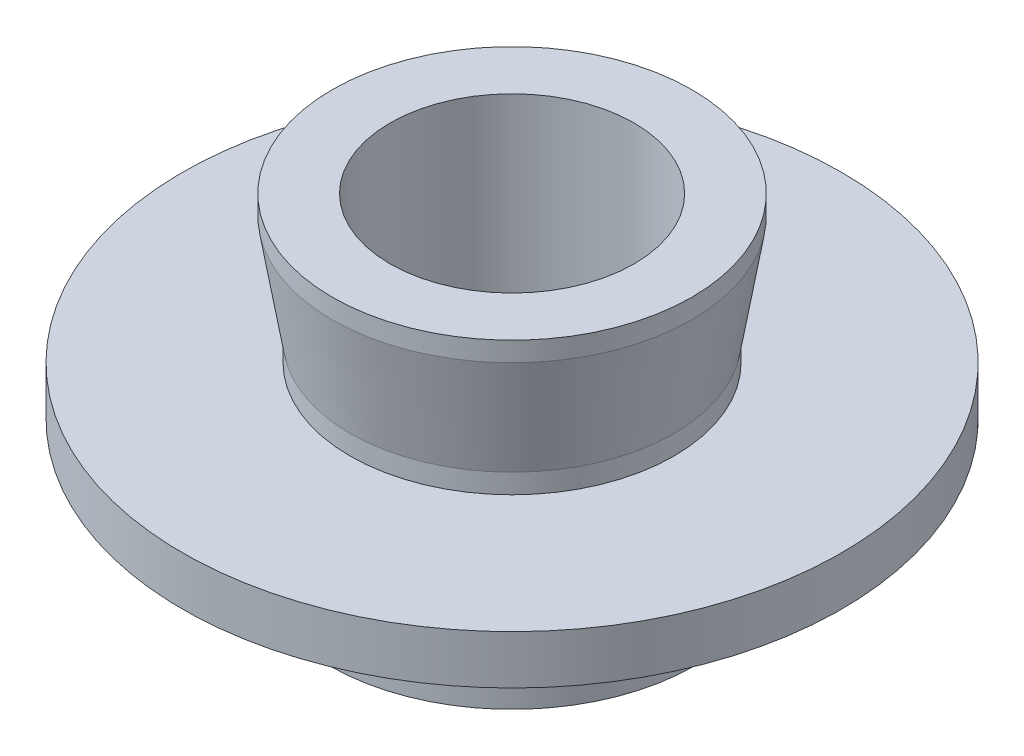
ISO-10303-21;
HEADER;
FILE_DESCRIPTION(('STEP AP214'),'2;1');
FILE_NAME('part.step','',(''),(''),'','','');
FILE_SCHEMA(('AUTOMOTIVE_DESIGN { 1 0 10303 214 1 1 1 1 }'));
ENDSEC;
DATA;
#1=APPLICATION_CONTEXT('core data for automotive mechanical design processes');
#2=APPLICATION_PROTOCOL_DEFINITION('international standard','automotive_design',2000,#1);
#3=PRODUCT_CONTEXT('',#1,'mechanical');
#4=PRODUCT('Part','Part','',(#3));
#5=PRODUCT_RELATED_PRODUCT_CATEGORY('part','',(#4));
#6=PRODUCT_DEFINITION_FORMATION('','',#4);
#7=PRODUCT_DEFINITION_CONTEXT('part definition',#1,'design');
#8=PRODUCT_DEFINITION('design','',#6,#7);
#9=PRODUCT_DEFINITION_SHAPE('','',#8);
#10=(LENGTH_UNIT() NAMED_UNIT(*) SI_UNIT(.MILLI.,.METRE.));
#11=(NAMED_UNIT(*) PLANE_ANGLE_UNIT() SI_UNIT($,.RADIAN.));
#12=(NAMED_UNIT(*) SI_UNIT($,.STERADIAN.) SOLID_ANGLE_UNIT());
#13=UNCERTAINTY_MEASURE_WITH_UNIT(LENGTH_MEASURE(1.E-05),#10,'distance_accuracy_value','');
#14=(GEOMETRIC_REPRESENTATION_CONTEXT(3) GLOBAL_UNCERTAINTY_ASSIGNED_CONTEXT((#13)) GLOBAL_UNIT_ASSIGNED_CONTEXT((#10,
#11,#12)) REPRESENTATION_CONTEXT('',''));
#15=CARTESIAN_POINT('',(0.,0.,0.));
#16=DIRECTION('',(0.,0.,1.));
#17=DIRECTION('',(1.,0.,0.));
#18=AXIS2_PLACEMENT_3D('',#15,#16,#17);
#19=CARTESIAN_POINT('',(-7.5,0.,0.));
#20=DIRECTION('',(0.,1.,0.));
#21=DIRECTION('',(0.,0.,1.));
#22=AXIS2_PLACEMENT_3D('',#19,#20,#21);
#23=PLANE('',#22);
#24=CARTESIAN_POINT('',(0.,0.,0.));
#25=DIRECTION('',(0.,-1.,0.));
#26=DIRECTION('',(0.,0.,-1.));
#27=AXIS2_PLACEMENT_3D('',#24,#25,#26);
#28=CIRCLE('',#27,5.);
#29=CARTESIAN_POINT('',(0.,0.,-5.));
#30=VERTEX_POINT('',#29);
#31=EDGE_CURVE('E10',#30,#30,#28,.T.);
#32=ORIENTED_EDGE('',*,*,#31,.F.);
#33=EDGE_LOOP('',(#32));
#34=FACE_BOUND('',#33,.T.);
#35=CARTESIAN_POINT('',(0.,0.,0.));
#36=DIRECTION('',(0.,-1.,0.));
#37=DIRECTION('',(0.,0.,-1.));
#38=AXIS2_PLACEMENT_3D('',#35,#36,#37);
#39=CIRCLE('',#38,7.5);
#40=CARTESIAN_POINT('',(0.,0.,-7.5));
#41=VERTEX_POINT('',#40);
#42=EDGE_CURVE('E77',#41,#41,#39,.T.);
#43=ORIENTED_EDGE('',*,*,#42,.T.);
#44=EDGE_LOOP('',(#43));
#45=FACE_BOUND('',#44,.T.);
#46=ADVANCED_FACE('F37',(#34,#45),#23,.F.);
#47=CARTESIAN_POINT('',(0.,0.,0.));
#48=DIRECTION('',(0.,-1.,0.));
#49=DIRECTION('',(0.,0.,-1.));
#50=AXIS2_PLACEMENT_3D('',#47,#48,#49);
#51=CYLINDRICAL_SURFACE('',#50,5.);
#52=CARTESIAN_POINT('',(0.,13.,0.));
#53=DIRECTION('',(0.,-1.,0.));
#54=DIRECTION('',(0.,0.,-1.));
#55=AXIS2_PLACEMENT_3D('',#52,#53,#54);
#56=CIRCLE('',#55,5.);
#57=CARTESIAN_POINT('',(0.,13.,-5.));
#58=VERTEX_POINT('',#57);
#59=EDGE_CURVE('E43',#58,#58,#56,.T.);
#60=ORIENTED_EDGE('',*,*,#59,.F.);
#61=EDGE_LOOP('',(#60));
#62=FACE_BOUND('',#61,.T.);
#63=ORIENTED_EDGE('',*,*,#31,.T.);
#64=EDGE_LOOP('',(#63));
#65=FACE_BOUND('',#64,.T.);
#66=ADVANCED_FACE('F138',(#62,#65),#51,.F.);
#67=CARTESIAN_POINT('',(-5.,13.,0.));
#68=DIRECTION('',(0.,-1.,0.));
#69=DIRECTION('',(0.,0.,-1.));
#70=AXIS2_PLACEMENT_3D('',#67,#68,#69);
#71=PLANE('',#70);
#72=CARTESIAN_POINT('',(0.,13.,0.));
#73=DIRECTION('',(0.,-1.,0.));
#74=DIRECTION('',(0.,0.,-1.));
#75=AXIS2_PLACEMENT_3D('',#72,#73,#74);
#76=CIRCLE('',#75,7.365);
#77=CARTESIAN_POINT('',(0.,13.,-7.365));
#78=VERTEX_POINT('',#77);
#79=EDGE_CURVE('E47',#78,#78,#76,.T.);
#80=ORIENTED_EDGE('',*,*,#79,.F.);
#81=EDGE_LOOP('',(#80));
#82=FACE_BOUND('',#81,.T.);
#83=ORIENTED_EDGE('',*,*,#59,.T.);
#84=EDGE_LOOP('',(#83));
#85=FACE_BOUND('',#84,.T.);
#86=ADVANCED_FACE('F133',(#82,#85),#71,.F.);
#87=CARTESIAN_POINT('',(0.,0.,0.));
#88=DIRECTION('',(0.,-1.,0.));
#89=DIRECTION('',(0.,0.,-1.));
#90=AXIS2_PLACEMENT_3D('',#87,#88,#89);
#91=CYLINDRICAL_SURFACE('',#90,7.365);
#92=CARTESIAN_POINT('',(0.,12.2,0.));
#93=DIRECTION('',(0.,-1.,0.));
#94=DIRECTION('',(0.,0.,-1.));
#95=AXIS2_PLACEMENT_3D('',#92,#93,#94);
#96=CIRCLE('',#95,7.365);
#97=CARTESIAN_POINT('',(0.,12.2,-7.365));
#98=VERTEX_POINT('',#97);
#99=EDGE_CURVE('E51',#98,#98,#96,.T.);
#100=ORIENTED_EDGE('',*,*,#99,.F.);
#101=EDGE_LOOP('',(#100));
#102=FACE_BOUND('',#101,.T.);
#103=ORIENTED_EDGE('',*,*,#79,.T.);
#104=EDGE_LOOP('',(#103));
#105=FACE_BOUND('',#104,.T.);
#106=ADVANCED_FACE('F127',(#102,#105),#91,.T.);
#107=CARTESIAN_POINT('',(0.,12.2,0.));
#108=DIRECTION('',(0.,1.,0.));
#109=DIRECTION('',(0.,0.,1.));
#110=AXIS2_PLACEMENT_3D('',#107,#108,#109);
#111=CONICAL_SURFACE('',#110,7.365,0.164411486247027);
#112=CARTESIAN_POINT('',(0.,7.8,0.));
#113=DIRECTION('',(0.,-1.,0.));
#114=DIRECTION('',(0.,0.,-1.));
#115=AXIS2_PLACEMENT_3D('',#112,#113,#114);
#116=CIRCLE('',#115,6.635);
#117=CARTESIAN_POINT('',(0.,7.8,-6.635));
#118=VERTEX_POINT('',#117);
#119=EDGE_CURVE('E56',#118,#118,#116,.T.);
#120=ORIENTED_EDGE('',*,*,#119,.F.);
#121=EDGE_LOOP('',(#120));
#122=FACE_BOUND('',#121,.T.);
#123=ORIENTED_EDGE('',*,*,#99,.T.);
#124=EDGE_LOOP('',(#123));
#125=FACE_BOUND('',#124,.T.);
#126=ADVANCED_FACE('F121',(#122,#125),#111,.T.);
#127=CARTESIAN_POINT('',(0.,0.,0.));
#128=DIRECTION('',(0.,-1.,0.));
#129=DIRECTION('',(0.,0.,-1.));
#130=AXIS2_PLACEMENT_3D('',#127,#128,#129);
#131=CYLINDRICAL_SURFACE('',#130,6.635);
#132=CARTESIAN_POINT('',(0.,7.,0.));
#133=DIRECTION('',(0.,-1.,0.));
#134=DIRECTION('',(0.,0.,-1.));
#135=AXIS2_PLACEMENT_3D('',#132,#133,#134);
#136=CIRCLE('',#135,6.635);
#137=CARTESIAN_POINT('',(0.,7.,-6.635));
#138=VERTEX_POINT('',#137);
#139=EDGE_CURVE('E59',#138,#138,#136,.T.);
#140=ORIENTED_EDGE('',*,*,#139,.F.);
#141=EDGE_LOOP('',(#140));
#142=FACE_BOUND('',#141,.T.);
#143=ORIENTED_EDGE('',*,*,#119,.T.);
#144=EDGE_LOOP('',(#143));
#145=FACE_BOUND('',#144,.T.);
#146=ADVANCED_FACE('F115',(#142,#145),#131,.T.);
#147=CARTESIAN_POINT('',(-6.635,7.,0.));
#148=DIRECTION('',(0.,-1.,0.));
#149=DIRECTION('',(0.,0.,-1.));
#150=AXIS2_PLACEMENT_3D('',#147,#148,#149);
#151=PLANE('',#150);
#152=CARTESIAN_POINT('',(0.,7.,0.));
#153=DIRECTION('',(0.,-1.,0.));
#154=DIRECTION('',(0.,0.,-1.));
#155=AXIS2_PLACEMENT_3D('',#152,#153,#154);
#156=CIRCLE('',#155,13.5);
#157=CARTESIAN_POINT('',(0.,7.,-13.5));
#158=VERTEX_POINT('',#157);
#159=EDGE_CURVE('E62',#158,#158,#156,.T.);
#160=ORIENTED_EDGE('',*,*,#159,.F.);
#161=EDGE_LOOP('',(#160));
#162=FACE_BOUND('',#161,.T.);
#163=ORIENTED_EDGE('',*,*,#139,.T.);
#164=EDGE_LOOP('',(#163));
#165=FACE_BOUND('',#164,.T.);
#166=ADVANCED_FACE('F109',(#162,#165),#151,.F.);
#167=CARTESIAN_POINT('',(0.,0.,0.));
#168=DIRECTION('',(0.,-1.,0.));
#169=DIRECTION('',(0.,0.,-1.));
#170=AXIS2_PLACEMENT_3D('',#167,#168,#169);
#171=CYLINDRICAL_SURFACE('',#170,13.5);
#172=CARTESIAN_POINT('',(0.,5.,0.));
#173=DIRECTION('',(0.,-1.,0.));
#174=DIRECTION('',(0.,0.,-1.));
#175=AXIS2_PLACEMENT_3D('',#172,#173,#174);
#176=CIRCLE('',#175,13.5);
#177=CARTESIAN_POINT('',(0.,5.,-13.5));
#178=VERTEX_POINT('',#177);
#179=EDGE_CURVE('E65',#178,#178,#176,.T.);
#180=ORIENTED_EDGE('',*,*,#179,.F.);
#181=EDGE_LOOP('',(#180));
#182=FACE_BOUND('',#181,.T.);
#183=ORIENTED_EDGE('',*,*,#159,.T.);
#184=EDGE_LOOP('',(#183));
#185=FACE_BOUND('',#184,.T.);
#186=ADVANCED_FACE('F103',(#182,#185),#171,.T.);
#187=CARTESIAN_POINT('',(-13.5,5.,0.));
#188=DIRECTION('',(0.,1.,0.));
#189=DIRECTION('',(0.,0.,1.));
#190=AXIS2_PLACEMENT_3D('',#187,#188,#189);
#191=PLANE('',#190);
#192=CARTESIAN_POINT('',(0.,5.,0.));
#193=DIRECTION('',(0.,-1.,0.));
#194=DIRECTION('',(0.,0.,-1.));
#195=AXIS2_PLACEMENT_3D('',#192,#193,#194);
#196=CIRCLE('',#195,7.1);
#197=CARTESIAN_POINT('',(0.,5.,-7.1));
#198=VERTEX_POINT('',#197);
#199=EDGE_CURVE('E68',#198,#198,#196,.T.);
#200=ORIENTED_EDGE('',*,*,#199,.F.);
#201=EDGE_LOOP('',(#200));
#202=FACE_BOUND('',#201,.T.);
#203=ORIENTED_EDGE('',*,*,#179,.T.);
#204=EDGE_LOOP('',(#203));
#205=FACE_BOUND('',#204,.T.);
#206=ADVANCED_FACE('F97',(#202,#205),#191,.F.);
#207=CARTESIAN_POINT('',(0.,0.,0.));
#208=DIRECTION('',(0.,-1.,0.));
#209=DIRECTION('',(0.,0.,-1.));
#210=AXIS2_PLACEMENT_3D('',#207,#208,#209);
#211=CYLINDRICAL_SURFACE('',#210,7.1);
#212=CARTESIAN_POINT('',(0.,4.,0.));
#213=DIRECTION('',(0.,-1.,0.));
#214=DIRECTION('',(0.,0.,-1.));
#215=AXIS2_PLACEMENT_3D('',#212,#213,#214);
#216=CIRCLE('',#215,7.1);
#217=CARTESIAN_POINT('',(0.,4.,-7.1));
#218=VERTEX_POINT('',#217);
#219=EDGE_CURVE('E71',#218,#218,#216,.T.);
#220=ORIENTED_EDGE('',*,*,#219,.F.);
#221=EDGE_LOOP('',(#220));
#222=FACE_BOUND('',#221,.T.);
#223=ORIENTED_EDGE('',*,*,#199,.T.);
#224=EDGE_LOOP('',(#223));
#225=FACE_BOUND('',#224,.T.);
#226=ADVANCED_FACE('F91',(#222,#225),#211,.T.);
#227=CARTESIAN_POINT('',(-7.1,4.,0.));
#228=DIRECTION('',(0.,-1.,0.));
#229=DIRECTION('',(0.,0.,-1.));
#230=AXIS2_PLACEMENT_3D('',#227,#228,#229);
#231=PLANE('',#230);
#232=CARTESIAN_POINT('',(0.,4.,0.));
#233=DIRECTION('',(0.,-1.,0.));
#234=DIRECTION('',(0.,0.,-1.));
#235=AXIS2_PLACEMENT_3D('',#232,#233,#234);
#236=CIRCLE('',#235,7.5);
#237=CARTESIAN_POINT('',(0.,4.,-7.5));
#238=VERTEX_POINT('',#237);
#239=EDGE_CURVE('E74',#238,#238,#236,.T.);
#240=ORIENTED_EDGE('',*,*,#239,.F.);
#241=EDGE_LOOP('',(#240));
#242=FACE_BOUND('',#241,.T.);
#243=ORIENTED_EDGE('',*,*,#219,.T.);
#244=EDGE_LOOP('',(#243));
#245=FACE_BOUND('',#244,.T.);
#246=ADVANCED_FACE('F85',(#242,#245),#231,.F.);
#247=CARTESIAN_POINT('',(0.,0.,0.));
#248=DIRECTION('',(0.,-1.,0.));
#249=DIRECTION('',(0.,0.,-1.));
#250=AXIS2_PLACEMENT_3D('',#247,#248,#249);
#251=CYLINDRICAL_SURFACE('',#250,7.5);
#252=ORIENTED_EDGE('',*,*,#42,.F.);
#253=EDGE_LOOP('',(#252));
#254=FACE_BOUND('',#253,.T.);
#255=ORIENTED_EDGE('',*,*,#239,.T.);
#256=EDGE_LOOP('',(#255));
#257=FACE_BOUND('',#256,.T.);
#258=ADVANCED_FACE('F82',(#254,#257),#251,.T.);
#259=CLOSED_SHELL('',(#46,#66,#86,#106,#126,#146,#166,#186,#206,#226,#246,#258));
#260=MANIFOLD_SOLID_BREP('B2',#259);
#261=ADVANCED_BREP_SHAPE_REPRESENTATION('',(#18,#260),#14);
#262=SHAPE_DEFINITION_REPRESENTATION(#9,#261);
ENDSEC;
END-ISO-10303-21;
